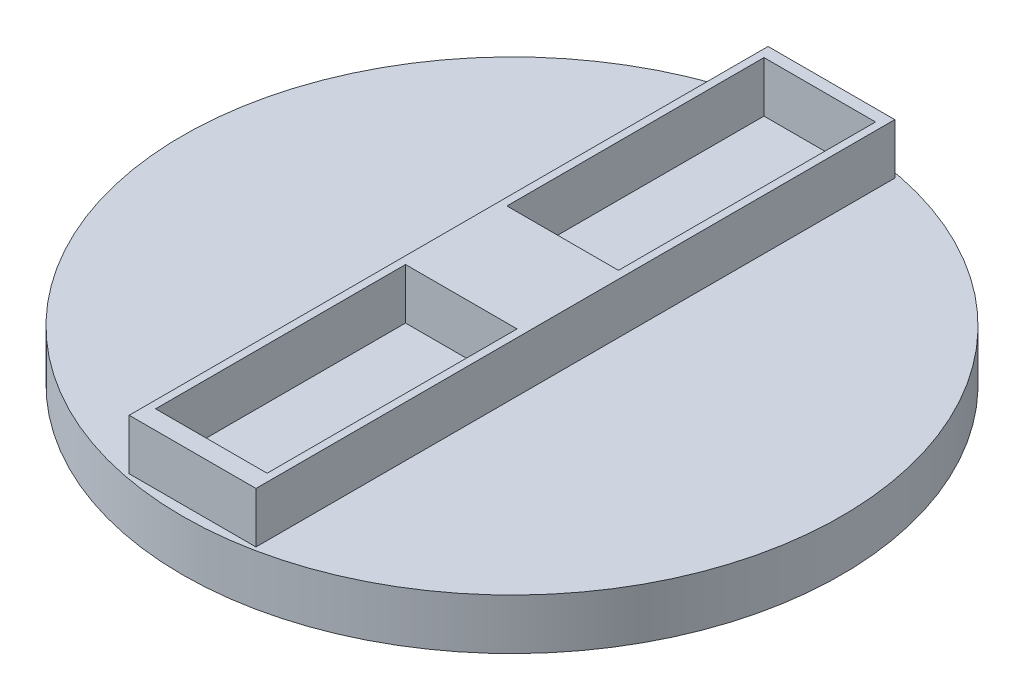
ISO-10303-21;
HEADER;
FILE_DESCRIPTION(('STEP AP214'),'2;1');
FILE_NAME('part.step','',(''),(''),'','','');
FILE_SCHEMA(('AUTOMOTIVE_DESIGN { 1 0 10303 214 1 1 1 1 }'));
ENDSEC;
DATA;
#1=APPLICATION_CONTEXT('core data for automotive mechanical design processes');
#2=APPLICATION_PROTOCOL_DEFINITION('international standard','automotive_design',2000,#1);
#3=PRODUCT_CONTEXT('',#1,'mechanical');
#4=PRODUCT('Part','Part','',(#3));
#5=PRODUCT_RELATED_PRODUCT_CATEGORY('part','',(#4));
#6=PRODUCT_DEFINITION_FORMATION('','',#4);
#7=PRODUCT_DEFINITION_CONTEXT('part definition',#1,'design');
#8=PRODUCT_DEFINITION('design','',#6,#7);
#9=PRODUCT_DEFINITION_SHAPE('','',#8);
#10=(LENGTH_UNIT() NAMED_UNIT(*) SI_UNIT(.MILLI.,.METRE.));
#11=(NAMED_UNIT(*) PLANE_ANGLE_UNIT() SI_UNIT($,.RADIAN.));
#12=(NAMED_UNIT(*) SI_UNIT($,.STERADIAN.) SOLID_ANGLE_UNIT());
#13=UNCERTAINTY_MEASURE_WITH_UNIT(LENGTH_MEASURE(1.E-05),#10,'distance_accuracy_value','');
#14=(GEOMETRIC_REPRESENTATION_CONTEXT(3) GLOBAL_UNCERTAINTY_ASSIGNED_CONTEXT((#13)) GLOBAL_UNIT_ASSIGNED_CONTEXT((#10,
#11,#12)) REPRESENTATION_CONTEXT('',''));
#15=CARTESIAN_POINT('',(0.,0.,0.));
#16=DIRECTION('',(0.,0.,1.));
#17=DIRECTION('',(1.,0.,0.));
#18=AXIS2_PLACEMENT_3D('',#15,#16,#17);
#19=CARTESIAN_POINT('',(0.,10.,0.));
#20=DIRECTION('',(0.,-1.,0.));
#21=DIRECTION('',(0.,0.,-1.));
#22=AXIS2_PLACEMENT_3D('',#19,#20,#21);
#23=PLANE('',#22);
#24=DIRECTION('',(0.,0.,-1.));
#25=VECTOR('',#24,1.);
#26=CARTESIAN_POINT('',(11.,10.,-10.));
#27=LINE('',#26,#25);
#28=CARTESIAN_POINT('',(11.,10.,-10.));
#29=VERTEX_POINT('',#28);
#30=CARTESIAN_POINT('',(11.,10.,-60.6981132075472));
#31=VERTEX_POINT('',#30);
#32=EDGE_CURVE('E152',#29,#31,#27,.T.);
#33=ORIENTED_EDGE('',*,*,#32,.F.);
#34=DIRECTION('',(1.,0.,0.));
#35=VECTOR('',#34,1.);
#36=CARTESIAN_POINT('',(-11.,10.,-10.));
#37=LINE('',#36,#35);
#38=CARTESIAN_POINT('',(-11.,10.,-10.));
#39=VERTEX_POINT('',#38);
#40=EDGE_CURVE('E160',#39,#29,#37,.T.);
#41=ORIENTED_EDGE('',*,*,#40,.F.);
#42=DIRECTION('',(0.,0.,1.));
#43=VECTOR('',#42,1.);
#44=CARTESIAN_POINT('',(-11.,10.,-10.));
#45=LINE('',#44,#43);
#46=CARTESIAN_POINT('',(-11.,10.,-60.6981132075472));
#47=VERTEX_POINT('',#46);
#48=EDGE_CURVE('E157',#47,#39,#45,.T.);
#49=ORIENTED_EDGE('',*,*,#48,.F.);
#50=DIRECTION('',(-1.,0.,0.));
#51=VECTOR('',#50,1.);
#52=CARTESIAN_POINT('',(-11.,10.,-60.6981132075472));
#53=LINE('',#52,#51);
#54=EDGE_CURVE('E154',#31,#47,#53,.T.);
#55=ORIENTED_EDGE('',*,*,#54,.F.);
#56=EDGE_LOOP('',(#33,#41,#49,#55));
#57=FACE_BOUND('',#56,.T.);
#58=DIRECTION('',(0.,0.,-1.));
#59=VECTOR('',#58,1.);
#60=CARTESIAN_POINT('',(12.5,10.,63.));
#61=LINE('',#60,#59);
#62=CARTESIAN_POINT('',(12.5,10.,63.));
#63=VERTEX_POINT('',#62);
#64=CARTESIAN_POINT('',(12.5,10.,-63.));
#65=VERTEX_POINT('',#64);
#66=EDGE_CURVE('E184',#63,#65,#61,.T.);
#67=ORIENTED_EDGE('',*,*,#66,.T.);
#68=DIRECTION('',(-1.,0.,0.));
#69=VECTOR('',#68,1.);
#70=CARTESIAN_POINT('',(-12.5,10.,-63.));
#71=LINE('',#70,#69);
#72=CARTESIAN_POINT('',(-12.5,10.,-63.));
#73=VERTEX_POINT('',#72);
#74=EDGE_CURVE('E187',#65,#73,#71,.T.);
#75=ORIENTED_EDGE('',*,*,#74,.T.);
#76=DIRECTION('',(0.,0.,1.));
#77=VECTOR('',#76,1.);
#78=CARTESIAN_POINT('',(-12.5,10.,63.));
#79=LINE('',#78,#77);
#80=CARTESIAN_POINT('',(-12.5,10.,63.));
#81=VERTEX_POINT('',#80);
#82=EDGE_CURVE('E190',#73,#81,#79,.T.);
#83=ORIENTED_EDGE('',*,*,#82,.T.);
#84=DIRECTION('',(1.,0.,0.));
#85=VECTOR('',#84,1.);
#86=CARTESIAN_POINT('',(-12.5,10.,63.));
#87=LINE('',#86,#85);
#88=EDGE_CURVE('E192',#81,#63,#87,.T.);
#89=ORIENTED_EDGE('',*,*,#88,.T.);
#90=EDGE_LOOP('',(#67,#75,#83,#89));
#91=FACE_BOUND('',#90,.T.);
#92=DIRECTION('',(0.,0.,1.));
#93=VECTOR('',#92,1.);
#94=CARTESIAN_POINT('',(-11.,10.,59.3018867924528));
#95=LINE('',#94,#93);
#96=CARTESIAN_POINT('',(-11.,10.,10.));
#97=VERTEX_POINT('',#96);
#98=CARTESIAN_POINT('',(-11.,10.,59.3018867924528));
#99=VERTEX_POINT('',#98);
#100=EDGE_CURVE('E127',#97,#99,#95,.T.);
#101=ORIENTED_EDGE('',*,*,#100,.F.);
#102=DIRECTION('',(-1.,0.,0.));
#103=VECTOR('',#102,1.);
#104=CARTESIAN_POINT('',(-11.,10.,10.));
#105=LINE('',#104,#103);
#106=CARTESIAN_POINT('',(11.,10.,10.));
#107=VERTEX_POINT('',#106);
#108=EDGE_CURVE('E146',#107,#97,#105,.T.);
#109=ORIENTED_EDGE('',*,*,#108,.F.);
#110=DIRECTION('',(0.,0.,-1.));
#111=VECTOR('',#110,1.);
#112=CARTESIAN_POINT('',(11.,10.,59.3018867924528));
#113=LINE('',#112,#111);
#114=CARTESIAN_POINT('',(11.,10.,59.3018867924528));
#115=VERTEX_POINT('',#114);
#116=EDGE_CURVE('E136',#115,#107,#113,.T.);
#117=ORIENTED_EDGE('',*,*,#116,.F.);
#118=DIRECTION('',(1.,0.,0.));
#119=VECTOR('',#118,1.);
#120=CARTESIAN_POINT('',(-11.,10.,59.3018867924528));
#121=LINE('',#120,#119);
#122=EDGE_CURVE('E233',#99,#115,#121,.T.);
#123=ORIENTED_EDGE('',*,*,#122,.F.);
#124=EDGE_LOOP('',(#101,#109,#117,#123));
#125=FACE_BOUND('',#124,.T.);
#126=ADVANCED_FACE('F33',(#57,#91,#125),#23,.F.);
#127=CARTESIAN_POINT('',(12.5,10.,63.));
#128=DIRECTION('',(-1.,0.,0.));
#129=DIRECTION('',(0.,0.,1.));
#130=AXIS2_PLACEMENT_3D('',#127,#128,#129);
#131=PLANE('',#130);
#132=DIRECTION('',(0.,0.,-1.));
#133=VECTOR('',#132,1.);
#134=CARTESIAN_POINT('',(12.5,0.,63.));
#135=LINE('',#134,#133);
#136=CARTESIAN_POINT('',(12.5,0.,63.));
#137=VERTEX_POINT('',#136);
#138=CARTESIAN_POINT('',(12.5,0.,-63.));
#139=VERTEX_POINT('',#138);
#140=EDGE_CURVE('E183',#137,#139,#135,.T.);
#141=ORIENTED_EDGE('',*,*,#140,.T.);
#142=DIRECTION('',(0.,-1.,0.));
#143=VECTOR('',#142,1.);
#144=CARTESIAN_POINT('',(12.5,10.,-63.));
#145=LINE('',#144,#143);
#146=EDGE_CURVE('E11',#65,#139,#145,.T.);
#147=ORIENTED_EDGE('',*,*,#146,.F.);
#148=ORIENTED_EDGE('',*,*,#66,.F.);
#149=DIRECTION('',(0.,-1.,0.));
#150=VECTOR('',#149,1.);
#151=CARTESIAN_POINT('',(12.5,10.,63.));
#152=LINE('',#151,#150);
#153=EDGE_CURVE('E194',#63,#137,#152,.T.);
#154=ORIENTED_EDGE('',*,*,#153,.T.);
#155=EDGE_LOOP('',(#141,#147,#148,#154));
#156=FACE_BOUND('',#155,.T.);
#157=ADVANCED_FACE('F35',(#156),#131,.F.);
#158=CARTESIAN_POINT('',(-12.5,10.,-63.));
#159=DIRECTION('',(0.,0.,1.));
#160=DIRECTION('',(1.,0.,0.));
#161=AXIS2_PLACEMENT_3D('',#158,#159,#160);
#162=PLANE('',#161);
#163=DIRECTION('',(-1.,0.,0.));
#164=VECTOR('',#163,1.);
#165=CARTESIAN_POINT('',(-12.5,0.,-63.));
#166=LINE('',#165,#164);
#167=CARTESIAN_POINT('',(-12.5,0.,-63.));
#168=VERTEX_POINT('',#167);
#169=EDGE_CURVE('E197',#139,#168,#166,.T.);
#170=ORIENTED_EDGE('',*,*,#169,.T.);
#171=DIRECTION('',(0.,-1.,0.));
#172=VECTOR('',#171,1.);
#173=CARTESIAN_POINT('',(-12.5,10.,-63.));
#174=LINE('',#173,#172);
#175=EDGE_CURVE('E41',#73,#168,#174,.T.);
#176=ORIENTED_EDGE('',*,*,#175,.F.);
#177=ORIENTED_EDGE('',*,*,#74,.F.);
#178=ORIENTED_EDGE('',*,*,#146,.T.);
#179=EDGE_LOOP('',(#170,#176,#177,#178));
#180=FACE_BOUND('',#179,.T.);
#181=ADVANCED_FACE('F216',(#180),#162,.F.);
#182=CARTESIAN_POINT('',(-12.5,10.,63.));
#183=DIRECTION('',(1.,0.,0.));
#184=DIRECTION('',(0.,0.,-1.));
#185=AXIS2_PLACEMENT_3D('',#182,#183,#184);
#186=PLANE('',#185);
#187=DIRECTION('',(0.,0.,1.));
#188=VECTOR('',#187,1.);
#189=CARTESIAN_POINT('',(-12.5,0.,63.));
#190=LINE('',#189,#188);
#191=CARTESIAN_POINT('',(-12.5,0.,63.));
#192=VERTEX_POINT('',#191);
#193=EDGE_CURVE('E200',#168,#192,#190,.T.);
#194=ORIENTED_EDGE('',*,*,#193,.T.);
#195=DIRECTION('',(0.,-1.,0.));
#196=VECTOR('',#195,1.);
#197=CARTESIAN_POINT('',(-12.5,10.,63.));
#198=LINE('',#197,#196);
#199=EDGE_CURVE('E207',#81,#192,#198,.T.);
#200=ORIENTED_EDGE('',*,*,#199,.F.);
#201=ORIENTED_EDGE('',*,*,#82,.F.);
#202=ORIENTED_EDGE('',*,*,#175,.T.);
#203=EDGE_LOOP('',(#194,#200,#201,#202));
#204=FACE_BOUND('',#203,.T.);
#205=ADVANCED_FACE('F213',(#204),#186,.F.);
#206=CARTESIAN_POINT('',(-12.5,10.,63.));
#207=DIRECTION('',(0.,0.,-1.));
#208=DIRECTION('',(-1.,0.,0.));
#209=AXIS2_PLACEMENT_3D('',#206,#207,#208);
#210=PLANE('',#209);
#211=DIRECTION('',(1.,0.,0.));
#212=VECTOR('',#211,1.);
#213=CARTESIAN_POINT('',(-12.5,0.,63.));
#214=LINE('',#213,#212);
#215=EDGE_CURVE('E188',#192,#137,#214,.T.);
#216=ORIENTED_EDGE('',*,*,#215,.T.);
#217=ORIENTED_EDGE('',*,*,#153,.F.);
#218=ORIENTED_EDGE('',*,*,#88,.F.);
#219=ORIENTED_EDGE('',*,*,#199,.T.);
#220=EDGE_LOOP('',(#216,#217,#218,#219));
#221=FACE_BOUND('',#220,.T.);
#222=ADVANCED_FACE('F222',(#221),#210,.F.);
#223=CARTESIAN_POINT('',(11.,10.,-10.));
#224=DIRECTION('',(-1.,0.,0.));
#225=DIRECTION('',(0.,0.,1.));
#226=AXIS2_PLACEMENT_3D('',#223,#224,#225);
#227=PLANE('',#226);
#228=DIRECTION('',(0.,0.,-1.));
#229=VECTOR('',#228,1.);
#230=CARTESIAN_POINT('',(11.,0.,-10.));
#231=LINE('',#230,#229);
#232=CARTESIAN_POINT('',(11.,0.,-10.));
#233=VERTEX_POINT('',#232);
#234=CARTESIAN_POINT('',(11.,0.,-60.6981132075472));
#235=VERTEX_POINT('',#234);
#236=EDGE_CURVE('E151',#233,#235,#231,.T.);
#237=ORIENTED_EDGE('',*,*,#236,.F.);
#238=DIRECTION('',(0.,-1.,0.));
#239=VECTOR('',#238,1.);
#240=CARTESIAN_POINT('',(11.,10.,-10.));
#241=LINE('',#240,#239);
#242=EDGE_CURVE('E162',#29,#233,#241,.T.);
#243=ORIENTED_EDGE('',*,*,#242,.F.);
#244=ORIENTED_EDGE('',*,*,#32,.T.);
#245=DIRECTION('',(0.,-1.,0.));
#246=VECTOR('',#245,1.);
#247=CARTESIAN_POINT('',(11.,10.,-60.6981132075472));
#248=LINE('',#247,#246);
#249=EDGE_CURVE('E180',#31,#235,#248,.T.);
#250=ORIENTED_EDGE('',*,*,#249,.T.);
#251=EDGE_LOOP('',(#237,#243,#244,#250));
#252=FACE_BOUND('',#251,.T.);
#253=ADVANCED_FACE('F285',(#252),#227,.T.);
#254=CARTESIAN_POINT('',(-11.,10.,-60.6981132075472));
#255=DIRECTION('',(0.,0.,1.));
#256=DIRECTION('',(1.,0.,0.));
#257=AXIS2_PLACEMENT_3D('',#254,#255,#256);
#258=PLANE('',#257);
#259=DIRECTION('',(-1.,0.,0.));
#260=VECTOR('',#259,1.);
#261=CARTESIAN_POINT('',(-11.,0.,-60.6981132075472));
#262=LINE('',#261,#260);
#263=CARTESIAN_POINT('',(-11.,0.,-60.6981132075472));
#264=VERTEX_POINT('',#263);
#265=EDGE_CURVE('E165',#235,#264,#262,.T.);
#266=ORIENTED_EDGE('',*,*,#265,.F.);
#267=ORIENTED_EDGE('',*,*,#249,.F.);
#268=ORIENTED_EDGE('',*,*,#54,.T.);
#269=DIRECTION('',(0.,-1.,0.));
#270=VECTOR('',#269,1.);
#271=CARTESIAN_POINT('',(-11.,10.,-60.6981132075472));
#272=LINE('',#271,#270);
#273=EDGE_CURVE('E178',#47,#264,#272,.T.);
#274=ORIENTED_EDGE('',*,*,#273,.T.);
#275=EDGE_LOOP('',(#266,#267,#268,#274));
#276=FACE_BOUND('',#275,.T.);
#277=ADVANCED_FACE('F281',(#276),#258,.T.);
#278=CARTESIAN_POINT('',(-11.,10.,-10.));
#279=DIRECTION('',(1.,0.,0.));
#280=DIRECTION('',(0.,0.,-1.));
#281=AXIS2_PLACEMENT_3D('',#278,#279,#280);
#282=PLANE('',#281);
#283=DIRECTION('',(0.,0.,1.));
#284=VECTOR('',#283,1.);
#285=CARTESIAN_POINT('',(-11.,0.,-10.));
#286=LINE('',#285,#284);
#287=CARTESIAN_POINT('',(-11.,0.,-10.));
#288=VERTEX_POINT('',#287);
#289=EDGE_CURVE('E168',#264,#288,#286,.T.);
#290=ORIENTED_EDGE('',*,*,#289,.F.);
#291=ORIENTED_EDGE('',*,*,#273,.F.);
#292=ORIENTED_EDGE('',*,*,#48,.T.);
#293=DIRECTION('',(0.,-1.,0.));
#294=VECTOR('',#293,1.);
#295=CARTESIAN_POINT('',(-11.,10.,-10.));
#296=LINE('',#295,#294);
#297=EDGE_CURVE('E175',#39,#288,#296,.T.);
#298=ORIENTED_EDGE('',*,*,#297,.T.);
#299=EDGE_LOOP('',(#290,#291,#292,#298));
#300=FACE_BOUND('',#299,.T.);
#301=ADVANCED_FACE('F277',(#300),#282,.T.);
#302=CARTESIAN_POINT('',(-11.,10.,-10.));
#303=DIRECTION('',(0.,0.,-1.));
#304=DIRECTION('',(-1.,0.,0.));
#305=AXIS2_PLACEMENT_3D('',#302,#303,#304);
#306=PLANE('',#305);
#307=DIRECTION('',(1.,0.,0.));
#308=VECTOR('',#307,1.);
#309=CARTESIAN_POINT('',(-11.,0.,-10.));
#310=LINE('',#309,#308);
#311=EDGE_CURVE('E155',#288,#233,#310,.T.);
#312=ORIENTED_EDGE('',*,*,#311,.F.);
#313=ORIENTED_EDGE('',*,*,#297,.F.);
#314=ORIENTED_EDGE('',*,*,#40,.T.);
#315=ORIENTED_EDGE('',*,*,#242,.T.);
#316=EDGE_LOOP('',(#312,#313,#314,#315));
#317=FACE_BOUND('',#316,.T.);
#318=ADVANCED_FACE('F274',(#317),#306,.T.);
#319=CARTESIAN_POINT('',(-11.,10.,59.3018867924528));
#320=DIRECTION('',(1.,0.,0.));
#321=DIRECTION('',(0.,0.,-1.));
#322=AXIS2_PLACEMENT_3D('',#319,#320,#321);
#323=PLANE('',#322);
#324=DIRECTION('',(0.,0.,1.));
#325=VECTOR('',#324,1.);
#326=CARTESIAN_POINT('',(-11.,0.,59.3018867924528));
#327=LINE('',#326,#325);
#328=CARTESIAN_POINT('',(-11.,0.,10.));
#329=VERTEX_POINT('',#328);
#330=CARTESIAN_POINT('',(-11.,0.,59.3018867924528));
#331=VERTEX_POINT('',#330);
#332=EDGE_CURVE('E56',#329,#331,#327,.T.);
#333=ORIENTED_EDGE('',*,*,#332,.F.);
#334=DIRECTION('',(0.,-1.,0.));
#335=VECTOR('',#334,1.);
#336=CARTESIAN_POINT('',(-11.,10.,10.));
#337=LINE('',#336,#335);
#338=EDGE_CURVE('E124',#97,#329,#337,.T.);
#339=ORIENTED_EDGE('',*,*,#338,.F.);
#340=ORIENTED_EDGE('',*,*,#100,.T.);
#341=DIRECTION('',(0.,-1.,0.));
#342=VECTOR('',#341,1.);
#343=CARTESIAN_POINT('',(-11.,10.,59.3018867924528));
#344=LINE('',#343,#342);
#345=EDGE_CURVE('E149',#99,#331,#344,.T.);
#346=ORIENTED_EDGE('',*,*,#345,.T.);
#347=EDGE_LOOP('',(#333,#339,#340,#346));
#348=FACE_BOUND('',#347,.T.);
#349=ADVANCED_FACE('F270',(#348),#323,.T.);
#350=CARTESIAN_POINT('',(-11.,10.,59.3018867924528));
#351=DIRECTION('',(0.,0.,-1.));
#352=DIRECTION('',(-1.,0.,0.));
#353=AXIS2_PLACEMENT_3D('',#350,#351,#352);
#354=PLANE('',#353);
#355=DIRECTION('',(1.,0.,0.));
#356=VECTOR('',#355,1.);
#357=CARTESIAN_POINT('',(-11.,0.,59.3018867924528));
#358=LINE('',#357,#356);
#359=CARTESIAN_POINT('',(11.,0.,59.3018867924528));
#360=VERTEX_POINT('',#359);
#361=EDGE_CURVE('E141',#331,#360,#358,.T.);
#362=ORIENTED_EDGE('',*,*,#361,.F.);
#363=ORIENTED_EDGE('',*,*,#345,.F.);
#364=ORIENTED_EDGE('',*,*,#122,.T.);
#365=DIRECTION('',(0.,-1.,0.));
#366=VECTOR('',#365,1.);
#367=CARTESIAN_POINT('',(11.,10.,59.3018867924528));
#368=LINE('',#367,#366);
#369=EDGE_CURVE('E138',#115,#360,#368,.T.);
#370=ORIENTED_EDGE('',*,*,#369,.T.);
#371=EDGE_LOOP('',(#362,#363,#364,#370));
#372=FACE_BOUND('',#371,.T.);
#373=ADVANCED_FACE('F267',(#372),#354,.T.);
#374=CARTESIAN_POINT('',(11.,10.,59.3018867924528));
#375=DIRECTION('',(-1.,0.,0.));
#376=DIRECTION('',(0.,0.,1.));
#377=AXIS2_PLACEMENT_3D('',#374,#375,#376);
#378=PLANE('',#377);
#379=DIRECTION('',(0.,0.,-1.));
#380=VECTOR('',#379,1.);
#381=CARTESIAN_POINT('',(11.,0.,59.3018867924528));
#382=LINE('',#381,#380);
#383=CARTESIAN_POINT('',(11.,0.,10.));
#384=VERTEX_POINT('',#383);
#385=EDGE_CURVE('E128',#360,#384,#382,.T.);
#386=ORIENTED_EDGE('',*,*,#385,.F.);
#387=ORIENTED_EDGE('',*,*,#369,.F.);
#388=ORIENTED_EDGE('',*,*,#116,.T.);
#389=DIRECTION('',(0.,-1.,0.));
#390=VECTOR('',#389,1.);
#391=CARTESIAN_POINT('',(11.,10.,10.));
#392=LINE('',#391,#390);
#393=EDGE_CURVE('E48',#107,#384,#392,.T.);
#394=ORIENTED_EDGE('',*,*,#393,.T.);
#395=EDGE_LOOP('',(#386,#387,#388,#394));
#396=FACE_BOUND('',#395,.T.);
#397=ADVANCED_FACE('F132',(#396),#378,.T.);
#398=CARTESIAN_POINT('',(-11.,10.,10.));
#399=DIRECTION('',(0.,0.,1.));
#400=DIRECTION('',(1.,0.,0.));
#401=AXIS2_PLACEMENT_3D('',#398,#399,#400);
#402=PLANE('',#401);
#403=DIRECTION('',(-1.,0.,0.));
#404=VECTOR('',#403,1.);
#405=CARTESIAN_POINT('',(-11.,0.,10.));
#406=LINE('',#405,#404);
#407=EDGE_CURVE('E122',#384,#329,#406,.T.);
#408=ORIENTED_EDGE('',*,*,#407,.F.);
#409=ORIENTED_EDGE('',*,*,#393,.F.);
#410=ORIENTED_EDGE('',*,*,#108,.T.);
#411=ORIENTED_EDGE('',*,*,#338,.T.);
#412=EDGE_LOOP('',(#408,#409,#410,#411));
#413=FACE_BOUND('',#412,.T.);
#414=ADVANCED_FACE('F123',(#413),#402,.T.);
#415=CARTESIAN_POINT('',(0.,0.,0.));
#416=DIRECTION('',(0.,1.,0.));
#417=DIRECTION('',(0.,0.,1.));
#418=AXIS2_PLACEMENT_3D('',#415,#416,#417);
#419=PLANE('',#418);
#420=ORIENTED_EDGE('',*,*,#385,.T.);
#421=ORIENTED_EDGE('',*,*,#407,.T.);
#422=ORIENTED_EDGE('',*,*,#332,.T.);
#423=ORIENTED_EDGE('',*,*,#361,.T.);
#424=EDGE_LOOP('',(#420,#421,#422,#423));
#425=FACE_BOUND('',#424,.T.);
#426=ADVANCED_FACE('F140',(#425),#419,.T.);
#427=ORIENTED_EDGE('',*,*,#289,.T.);
#428=ORIENTED_EDGE('',*,*,#311,.T.);
#429=ORIENTED_EDGE('',*,*,#236,.T.);
#430=ORIENTED_EDGE('',*,*,#265,.T.);
#431=EDGE_LOOP('',(#427,#428,#429,#430));
#432=FACE_BOUND('',#431,.T.);
#433=ADVANCED_FACE('F260',(#432),#419,.T.);
#434=CARTESIAN_POINT('',(0.,0.,0.));
#435=DIRECTION('',(0.,1.,0.));
#436=DIRECTION('',(0.,0.,1.));
#437=AXIS2_PLACEMENT_3D('',#434,#435,#436);
#438=CIRCLE('',#437,65.);
#439=CARTESIAN_POINT('',(0.,0.,65.));
#440=VERTEX_POINT('',#439);
#441=EDGE_CURVE('E238',#440,#440,#438,.T.);
#442=ORIENTED_EDGE('',*,*,#441,.T.);
#443=EDGE_LOOP('',(#442));
#444=FACE_BOUND('',#443,.T.);
#445=ORIENTED_EDGE('',*,*,#140,.F.);
#446=ORIENTED_EDGE('',*,*,#215,.F.);
#447=ORIENTED_EDGE('',*,*,#193,.F.);
#448=ORIENTED_EDGE('',*,*,#169,.F.);
#449=EDGE_LOOP('',(#445,#446,#447,#448));
#450=FACE_BOUND('',#449,.T.);
#451=ADVANCED_FACE('F219',(#444,#450),#419,.T.);
#452=CARTESIAN_POINT('',(0.,-10.,0.));
#453=DIRECTION('',(0.,1.,0.));
#454=DIRECTION('',(0.,0.,1.));
#455=AXIS2_PLACEMENT_3D('',#452,#453,#454);
#456=CYLINDRICAL_SURFACE('',#455,65.);
#457=CARTESIAN_POINT('',(0.,-10.,0.));
#458=DIRECTION('',(0.,1.,0.));
#459=DIRECTION('',(0.,0.,1.));
#460=AXIS2_PLACEMENT_3D('',#457,#458,#459);
#461=CIRCLE('',#460,65.);
#462=CARTESIAN_POINT('',(0.,-10.,65.));
#463=VERTEX_POINT('',#462);
#464=EDGE_CURVE('E242',#463,#463,#461,.T.);
#465=ORIENTED_EDGE('',*,*,#464,.T.);
#466=EDGE_LOOP('',(#465));
#467=FACE_BOUND('',#466,.T.);
#468=ORIENTED_EDGE('',*,*,#441,.F.);
#469=EDGE_LOOP('',(#468));
#470=FACE_BOUND('',#469,.T.);
#471=ADVANCED_FACE('F250',(#467,#470),#456,.T.);
#472=CARTESIAN_POINT('',(0.,-10.,0.));
#473=DIRECTION('',(0.,1.,0.));
#474=DIRECTION('',(0.,0.,1.));
#475=AXIS2_PLACEMENT_3D('',#472,#473,#474);
#476=PLANE('',#475);
#477=ORIENTED_EDGE('',*,*,#464,.F.);
#478=EDGE_LOOP('',(#477));
#479=FACE_BOUND('',#478,.T.);
#480=ADVANCED_FACE('F252',(#479),#476,.F.);
#481=CLOSED_SHELL('',(#126,#157,#181,#205,#222,#253,#277,#301,#318,#349,#373,#397,#414,#426,
#433,#451,#471,#480));
#482=MANIFOLD_SOLID_BREP('B2',#481);
#483=ADVANCED_BREP_SHAPE_REPRESENTATION('',(#18,#482),#14);
#484=SHAPE_DEFINITION_REPRESENTATION(#9,#483);
ENDSEC;
END-ISO-10303-21;
